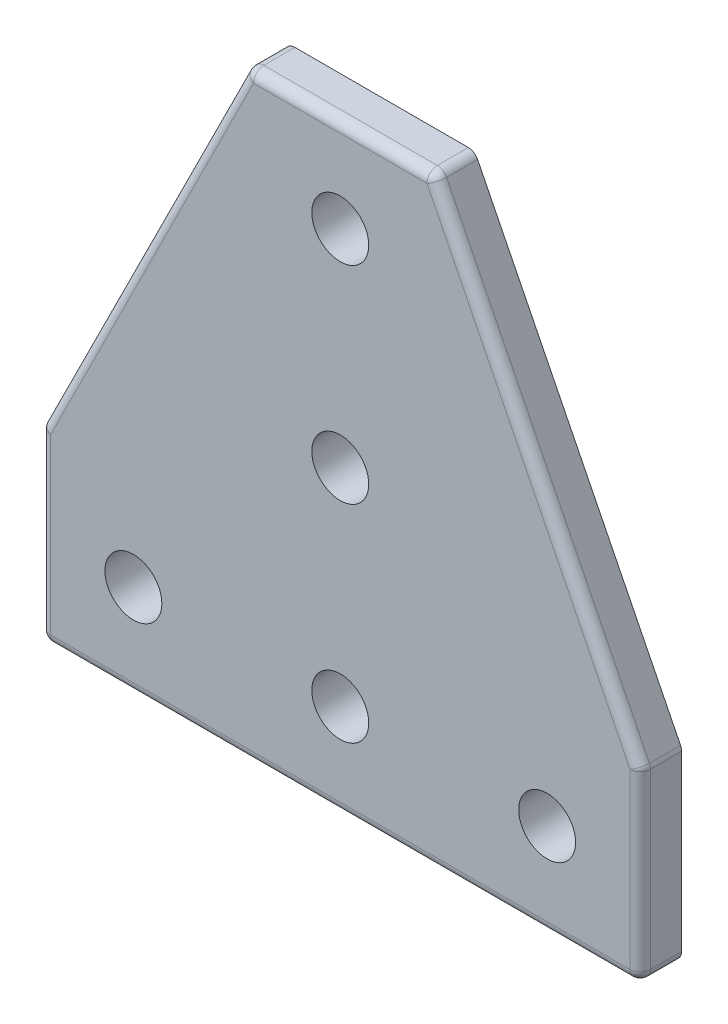
ISO-10303-21;
HEADER;
FILE_DESCRIPTION(('STEP AP214'),'2;1');
FILE_NAME('part.step','',(''),(''),'','','');
FILE_SCHEMA(('AUTOMOTIVE_DESIGN { 1 0 10303 214 1 1 1 1 }'));
ENDSEC;
DATA;
#1=APPLICATION_CONTEXT('core data for automotive mechanical design processes');
#2=APPLICATION_PROTOCOL_DEFINITION('international standard','automotive_design',2000,#1);
#3=PRODUCT_CONTEXT('',#1,'mechanical');
#4=PRODUCT('Part','Part','',(#3));
#5=PRODUCT_RELATED_PRODUCT_CATEGORY('part','',(#4));
#6=PRODUCT_DEFINITION_FORMATION('','',#4);
#7=PRODUCT_DEFINITION_CONTEXT('part definition',#1,'design');
#8=PRODUCT_DEFINITION('design','',#6,#7);
#9=PRODUCT_DEFINITION_SHAPE('','',#8);
#10=(LENGTH_UNIT() NAMED_UNIT(*) SI_UNIT(.MILLI.,.METRE.));
#11=(NAMED_UNIT(*) PLANE_ANGLE_UNIT() SI_UNIT($,.RADIAN.));
#12=(NAMED_UNIT(*) SI_UNIT($,.STERADIAN.) SOLID_ANGLE_UNIT());
#13=UNCERTAINTY_MEASURE_WITH_UNIT(LENGTH_MEASURE(1.E-05),#10,'distance_accuracy_value','');
#14=(GEOMETRIC_REPRESENTATION_CONTEXT(3) GLOBAL_UNCERTAINTY_ASSIGNED_CONTEXT((#13)) GLOBAL_UNIT_ASSIGNED_CONTEXT((#10,
#11,#12)) REPRESENTATION_CONTEXT('',''));
#15=CARTESIAN_POINT('',(0.,0.,0.));
#16=DIRECTION('',(0.,0.,1.));
#17=DIRECTION('',(1.,0.,0.));
#18=AXIS2_PLACEMENT_3D('',#15,#16,#17);
#19=CARTESIAN_POINT('',(0.,0.,2.));
#20=DIRECTION('',(0.,0.,-1.));
#21=DIRECTION('',(-1.,0.,0.));
#22=AXIS2_PLACEMENT_3D('',#19,#20,#21);
#23=PLANE('',#22);
#24=DIRECTION('',(-0.447213595499958,-0.894427190999916,0.));
#25=VECTOR('',#24,1.);
#26=CARTESIAN_POINT('',(-6.30557280900007,3.15278640450004,2.));
#27=LINE('',#26,#25);
#28=CARTESIAN_POINT('',(20.6180339887499,57.,2.));
#29=VERTEX_POINT('',#28);
#30=CARTESIAN_POINT('',(0.999999999999998,17.7639320225002,2.));
#31=VERTEX_POINT('',#30);
#32=EDGE_CURVE('E218',#29,#31,#27,.T.);
#33=ORIENTED_EDGE('',*,*,#32,.T.);
#34=DIRECTION('',(0.,-1.,0.));
#35=VECTOR('',#34,1.);
#36=CARTESIAN_POINT('',(1.,0.,2.));
#37=LINE('',#36,#35);
#38=CARTESIAN_POINT('',(1.,1.,2.));
#39=VERTEX_POINT('',#38);
#40=EDGE_CURVE('E255',#31,#39,#37,.T.);
#41=ORIENTED_EDGE('',*,*,#40,.T.);
#42=DIRECTION('',(1.,0.,0.));
#43=VECTOR('',#42,1.);
#44=CARTESIAN_POINT('',(0.,1.,2.));
#45=LINE('',#44,#43);
#46=CARTESIAN_POINT('',(57.,1.,2.));
#47=VERTEX_POINT('',#46);
#48=EDGE_CURVE('E253',#39,#47,#45,.T.);
#49=ORIENTED_EDGE('',*,*,#48,.T.);
#50=DIRECTION('',(0.,1.,0.));
#51=VECTOR('',#50,1.);
#52=CARTESIAN_POINT('',(57.,0.,2.));
#53=LINE('',#52,#51);
#54=CARTESIAN_POINT('',(57.,17.7639320225002,2.));
#55=VERTEX_POINT('',#54);
#56=EDGE_CURVE('E214',#47,#55,#53,.T.);
#57=ORIENTED_EDGE('',*,*,#56,.T.);
#58=DIRECTION('',(-0.447213595499958,0.894427190999916,0.));
#59=VECTOR('',#58,1.);
#60=CARTESIAN_POINT('',(52.7055728090001,26.3527864045,2.));
#61=LINE('',#60,#59);
#62=CARTESIAN_POINT('',(37.3819660112501,57.,2.));
#63=VERTEX_POINT('',#62);
#64=EDGE_CURVE('E206',#55,#63,#61,.T.);
#65=ORIENTED_EDGE('',*,*,#64,.T.);
#66=DIRECTION('',(-1.,0.,0.));
#67=VECTOR('',#66,1.);
#68=CARTESIAN_POINT('',(0.,57.,2.));
#69=LINE('',#68,#67);
#70=EDGE_CURVE('E211',#63,#29,#69,.T.);
#71=ORIENTED_EDGE('',*,*,#70,.T.);
#72=EDGE_LOOP('',(#33,#41,#49,#57,#65,#71));
#73=FACE_BOUND('',#72,.T.);
#74=CARTESIAN_POINT('',(29.,29.,2.));
#75=DIRECTION('',(0.,0.,1.));
#76=DIRECTION('',(1.,0.,0.));
#77=AXIS2_PLACEMENT_3D('',#74,#75,#76);
#78=CIRCLE('',#77,2.75000000000001);
#79=CARTESIAN_POINT('',(31.75,29.,2.));
#80=VERTEX_POINT('',#79);
#81=EDGE_CURVE('E348',#80,#80,#78,.T.);
#82=ORIENTED_EDGE('',*,*,#81,.F.);
#83=EDGE_LOOP('',(#82));
#84=FACE_BOUND('',#83,.T.);
#85=CARTESIAN_POINT('',(29.,8.99999999999999,2.));
#86=DIRECTION('',(0.,0.,1.));
#87=DIRECTION('',(1.,0.,0.));
#88=AXIS2_PLACEMENT_3D('',#85,#86,#87);
#89=CIRCLE('',#88,2.75);
#90=CARTESIAN_POINT('',(31.75,8.99999999999999,2.));
#91=VERTEX_POINT('',#90);
#92=EDGE_CURVE('E360',#91,#91,#89,.T.);
#93=ORIENTED_EDGE('',*,*,#92,.F.);
#94=EDGE_LOOP('',(#93));
#95=FACE_BOUND('',#94,.T.);
#96=CARTESIAN_POINT('',(9.,8.99999999999999,2.));
#97=DIRECTION('',(0.,0.,1.));
#98=DIRECTION('',(1.,0.,0.));
#99=AXIS2_PLACEMENT_3D('',#96,#97,#98);
#100=CIRCLE('',#99,2.75);
#101=CARTESIAN_POINT('',(11.75,8.99999999999999,2.));
#102=VERTEX_POINT('',#101);
#103=EDGE_CURVE('E366',#102,#102,#100,.T.);
#104=ORIENTED_EDGE('',*,*,#103,.F.);
#105=EDGE_LOOP('',(#104));
#106=FACE_BOUND('',#105,.T.);
#107=CARTESIAN_POINT('',(49.,8.99999999999999,2.));
#108=DIRECTION('',(0.,0.,1.));
#109=DIRECTION('',(1.,0.,0.));
#110=AXIS2_PLACEMENT_3D('',#107,#108,#109);
#111=CIRCLE('',#110,2.75000000000001);
#112=CARTESIAN_POINT('',(51.75,8.99999999999999,2.));
#113=VERTEX_POINT('',#112);
#114=EDGE_CURVE('E354',#113,#113,#111,.T.);
#115=ORIENTED_EDGE('',*,*,#114,.F.);
#116=EDGE_LOOP('',(#115));
#117=FACE_BOUND('',#116,.T.);
#118=CARTESIAN_POINT('',(29.,49.,2.));
#119=DIRECTION('',(0.,0.,1.));
#120=DIRECTION('',(1.,0.,0.));
#121=AXIS2_PLACEMENT_3D('',#118,#119,#120);
#122=CIRCLE('',#121,2.75);
#123=CARTESIAN_POINT('',(31.75,49.,2.));
#124=VERTEX_POINT('',#123);
#125=EDGE_CURVE('E340',#124,#124,#122,.T.);
#126=ORIENTED_EDGE('',*,*,#125,.F.);
#127=EDGE_LOOP('',(#126));
#128=FACE_BOUND('',#127,.T.);
#129=ADVANCED_FACE('F100',(#73,#84,#95,#106,#117,#128),#23,.F.);
#130=CARTESIAN_POINT('',(0.,0.,-2.));
#131=DIRECTION('',(0.,0.,-1.));
#132=DIRECTION('',(-1.,0.,0.));
#133=AXIS2_PLACEMENT_3D('',#130,#131,#132);
#134=PLANE('',#133);
#135=CARTESIAN_POINT('',(29.,29.,-2.));
#136=DIRECTION('',(0.,0.,1.));
#137=DIRECTION('',(1.,0.,0.));
#138=AXIS2_PLACEMENT_3D('',#135,#136,#137);
#139=CIRCLE('',#138,2.75000000000001);
#140=CARTESIAN_POINT('',(31.75,29.,-2.));
#141=VERTEX_POINT('',#140);
#142=EDGE_CURVE('E345',#141,#141,#139,.T.);
#143=ORIENTED_EDGE('',*,*,#142,.T.);
#144=EDGE_LOOP('',(#143));
#145=FACE_BOUND('',#144,.T.);
#146=CARTESIAN_POINT('',(29.,8.99999999999999,-2.));
#147=DIRECTION('',(0.,0.,1.));
#148=DIRECTION('',(1.,0.,0.));
#149=AXIS2_PLACEMENT_3D('',#146,#147,#148);
#150=CIRCLE('',#149,2.75);
#151=CARTESIAN_POINT('',(31.75,8.99999999999999,-2.));
#152=VERTEX_POINT('',#151);
#153=EDGE_CURVE('E357',#152,#152,#150,.T.);
#154=ORIENTED_EDGE('',*,*,#153,.T.);
#155=EDGE_LOOP('',(#154));
#156=FACE_BOUND('',#155,.T.);
#157=DIRECTION('',(-0.447213595499958,-0.894427190999916,0.));
#158=VECTOR('',#157,1.);
#159=CARTESIAN_POINT('',(0.,18.,-2.));
#160=LINE('',#159,#158);
#161=CARTESIAN_POINT('',(19.72360679775,57.4472135955,-2.));
#162=VERTEX_POINT('',#161);
#163=CARTESIAN_POINT('',(0.105572809000083,18.2111456180001,-2.));
#164=VERTEX_POINT('',#163);
#165=EDGE_CURVE('E247',#162,#164,#160,.T.);
#166=ORIENTED_EDGE('',*,*,#165,.F.);
#167=CARTESIAN_POINT('',(20.6180339887499,57.,-2.));
#168=DIRECTION('',(0.,0.,-1.));
#169=DIRECTION('',(-1.,0.,0.));
#170=AXIS2_PLACEMENT_3D('',#167,#168,#169);
#171=CIRCLE('',#170,1.);
#172=CARTESIAN_POINT('',(20.6180339887499,58.,-2.));
#173=VERTEX_POINT('',#172);
#174=EDGE_CURVE('E274',#162,#173,#171,.T.);
#175=ORIENTED_EDGE('',*,*,#174,.T.);
#176=DIRECTION('',(-1.,0.,0.));
#177=VECTOR('',#176,1.);
#178=CARTESIAN_POINT('',(38.,58.,-2.));
#179=LINE('',#178,#177);
#180=CARTESIAN_POINT('',(37.3819660112501,58.,-2.));
#181=VERTEX_POINT('',#180);
#182=EDGE_CURVE('E379',#181,#173,#179,.T.);
#183=ORIENTED_EDGE('',*,*,#182,.F.);
#184=CARTESIAN_POINT('',(37.3819660112501,57.,-2.));
#185=DIRECTION('',(0.,0.,-1.));
#186=DIRECTION('',(-1.,0.,0.));
#187=AXIS2_PLACEMENT_3D('',#184,#185,#186);
#188=CIRCLE('',#187,1.);
#189=CARTESIAN_POINT('',(38.27639320225,57.4472135955,-2.));
#190=VERTEX_POINT('',#189);
#191=EDGE_CURVE('E268',#181,#190,#188,.T.);
#192=ORIENTED_EDGE('',*,*,#191,.T.);
#193=DIRECTION('',(-0.447213595499958,0.894427190999916,0.));
#194=VECTOR('',#193,1.);
#195=CARTESIAN_POINT('',(38.,58.,-2.));
#196=LINE('',#195,#194);
#197=CARTESIAN_POINT('',(57.8944271909999,18.2111456180002,-2.));
#198=VERTEX_POINT('',#197);
#199=EDGE_CURVE('E376',#198,#190,#196,.T.);
#200=ORIENTED_EDGE('',*,*,#199,.F.);
#201=CARTESIAN_POINT('',(57.,17.7639320225002,-2.));
#202=DIRECTION('',(0.,0.,-1.));
#203=DIRECTION('',(-1.,0.,0.));
#204=AXIS2_PLACEMENT_3D('',#201,#202,#203);
#205=CIRCLE('',#204,1.);
#206=CARTESIAN_POINT('',(58.,17.7639320225002,-2.));
#207=VERTEX_POINT('',#206);
#208=EDGE_CURVE('E270',#198,#207,#205,.T.);
#209=ORIENTED_EDGE('',*,*,#208,.T.);
#210=DIRECTION('',(0.,1.,0.));
#211=VECTOR('',#210,1.);
#212=CARTESIAN_POINT('',(58.,18.,-2.));
#213=LINE('',#212,#211);
#214=CARTESIAN_POINT('',(58.,1.,-2.));
#215=VERTEX_POINT('',#214);
#216=EDGE_CURVE('E373',#215,#207,#213,.T.);
#217=ORIENTED_EDGE('',*,*,#216,.F.);
#218=CARTESIAN_POINT('',(57.,1.,-2.));
#219=DIRECTION('',(0.,0.,-1.));
#220=DIRECTION('',(-1.,0.,0.));
#221=AXIS2_PLACEMENT_3D('',#218,#219,#220);
#222=CIRCLE('',#221,1.);
#223=CARTESIAN_POINT('',(57.,0.,-2.));
#224=VERTEX_POINT('',#223);
#225=EDGE_CURVE('E264',#215,#224,#222,.T.);
#226=ORIENTED_EDGE('',*,*,#225,.T.);
#227=DIRECTION('',(1.,0.,0.));
#228=VECTOR('',#227,1.);
#229=CARTESIAN_POINT('',(58.,0.,-2.));
#230=LINE('',#229,#228);
#231=CARTESIAN_POINT('',(1.00000000000001,0.,-2.));
#232=VERTEX_POINT('',#231);
#233=EDGE_CURVE('E369',#232,#224,#230,.T.);
#234=ORIENTED_EDGE('',*,*,#233,.F.);
#235=CARTESIAN_POINT('',(1.,1.,-2.));
#236=DIRECTION('',(0.,0.,-1.));
#237=DIRECTION('',(-1.,0.,0.));
#238=AXIS2_PLACEMENT_3D('',#235,#236,#237);
#239=CIRCLE('',#238,1.);
#240=CARTESIAN_POINT('',(0.,1.,-2.));
#241=VERTEX_POINT('',#240);
#242=EDGE_CURVE('E266',#232,#241,#239,.T.);
#243=ORIENTED_EDGE('',*,*,#242,.T.);
#244=DIRECTION('',(0.,-1.,0.));
#245=VECTOR('',#244,1.);
#246=CARTESIAN_POINT('',(0.,0.,-2.));
#247=LINE('',#246,#245);
#248=CARTESIAN_POINT('',(0.,17.7639320225002,-2.));
#249=VERTEX_POINT('',#248);
#250=EDGE_CURVE('E244',#249,#241,#247,.T.);
#251=ORIENTED_EDGE('',*,*,#250,.F.);
#252=CARTESIAN_POINT('',(0.999999999999998,17.7639320225002,-2.));
#253=DIRECTION('',(0.,0.,-1.));
#254=DIRECTION('',(-1.,0.,0.));
#255=AXIS2_PLACEMENT_3D('',#252,#253,#254);
#256=CIRCLE('',#255,1.);
#257=EDGE_CURVE('E272',#249,#164,#256,.T.);
#258=ORIENTED_EDGE('',*,*,#257,.T.);
#259=EDGE_LOOP('',(#166,#175,#183,#192,#200,#209,#217,#226,#234,#243,#251,#258));
#260=FACE_BOUND('',#259,.T.);
#261=CARTESIAN_POINT('',(9.,8.99999999999999,-2.));
#262=DIRECTION('',(0.,0.,1.));
#263=DIRECTION('',(1.,0.,0.));
#264=AXIS2_PLACEMENT_3D('',#261,#262,#263);
#265=CIRCLE('',#264,2.75);
#266=CARTESIAN_POINT('',(11.75,8.99999999999999,-2.));
#267=VERTEX_POINT('',#266);
#268=EDGE_CURVE('E363',#267,#267,#265,.T.);
#269=ORIENTED_EDGE('',*,*,#268,.T.);
#270=EDGE_LOOP('',(#269));
#271=FACE_BOUND('',#270,.T.);
#272=CARTESIAN_POINT('',(49.,8.99999999999999,-2.));
#273=DIRECTION('',(0.,0.,1.));
#274=DIRECTION('',(1.,0.,0.));
#275=AXIS2_PLACEMENT_3D('',#272,#273,#274);
#276=CIRCLE('',#275,2.75000000000001);
#277=CARTESIAN_POINT('',(51.75,8.99999999999999,-2.));
#278=VERTEX_POINT('',#277);
#279=EDGE_CURVE('E351',#278,#278,#276,.T.);
#280=ORIENTED_EDGE('',*,*,#279,.T.);
#281=EDGE_LOOP('',(#280));
#282=FACE_BOUND('',#281,.T.);
#283=CARTESIAN_POINT('',(29.,49.,-2.));
#284=DIRECTION('',(0.,0.,1.));
#285=DIRECTION('',(1.,0.,0.));
#286=AXIS2_PLACEMENT_3D('',#283,#284,#285);
#287=CIRCLE('',#286,2.75);
#288=CARTESIAN_POINT('',(31.75,49.,-2.));
#289=VERTEX_POINT('',#288);
#290=EDGE_CURVE('E337',#289,#289,#287,.T.);
#291=ORIENTED_EDGE('',*,*,#290,.T.);
#292=EDGE_LOOP('',(#291));
#293=FACE_BOUND('',#292,.T.);
#294=ADVANCED_FACE('F421',(#145,#156,#260,#271,#282,#293),#134,.T.);
#295=CARTESIAN_POINT('',(58.,0.,2.));
#296=DIRECTION('',(0.,1.,0.));
#297=DIRECTION('',(-1.,0.,0.));
#298=AXIS2_PLACEMENT_3D('',#295,#296,#297);
#299=PLANE('',#298);
#300=DIRECTION('',(1.,0.,0.));
#301=VECTOR('',#300,1.);
#302=CARTESIAN_POINT('',(58.,0.,1.));
#303=LINE('',#302,#301);
#304=CARTESIAN_POINT('',(57.,0.,1.));
#305=VERTEX_POINT('',#304);
#306=CARTESIAN_POINT('',(1.,0.,1.));
#307=VERTEX_POINT('',#306);
#308=EDGE_CURVE('E109',#305,#307,#303,.F.);
#309=ORIENTED_EDGE('',*,*,#308,.T.);
#310=DIRECTION('',(0.,0.,-1.));
#311=VECTOR('',#310,1.);
#312=CARTESIAN_POINT('',(1.,0.,2.));
#313=LINE('',#312,#311);
#314=EDGE_CURVE('E12',#307,#232,#313,.T.);
#315=ORIENTED_EDGE('',*,*,#314,.T.);
#316=ORIENTED_EDGE('',*,*,#233,.T.);
#317=DIRECTION('',(0.,0.,-1.));
#318=VECTOR('',#317,1.);
#319=CARTESIAN_POINT('',(57.,0.,2.));
#320=LINE('',#319,#318);
#321=EDGE_CURVE('E120',#224,#305,#320,.F.);
#322=ORIENTED_EDGE('',*,*,#321,.T.);
#323=EDGE_LOOP('',(#309,#315,#316,#322));
#324=FACE_BOUND('',#323,.T.);
#325=ADVANCED_FACE('F420',(#324),#299,.F.);
#326=CARTESIAN_POINT('',(58.,18.,2.));
#327=DIRECTION('',(-1.,0.,0.));
#328=DIRECTION('',(0.,0.,1.));
#329=AXIS2_PLACEMENT_3D('',#326,#327,#328);
#330=PLANE('',#329);
#331=ORIENTED_EDGE('',*,*,#216,.T.);
#332=DIRECTION('',(0.,0.,-1.));
#333=VECTOR('',#332,1.);
#334=CARTESIAN_POINT('',(58.,17.7639320225002,2.));
#335=LINE('',#334,#333);
#336=CARTESIAN_POINT('',(58.,17.7639320225002,1.));
#337=VERTEX_POINT('',#336);
#338=EDGE_CURVE('E297',#207,#337,#335,.F.);
#339=ORIENTED_EDGE('',*,*,#338,.T.);
#340=DIRECTION('',(0.,1.,0.));
#341=VECTOR('',#340,1.);
#342=CARTESIAN_POINT('',(58.,18.,1.));
#343=LINE('',#342,#341);
#344=CARTESIAN_POINT('',(58.,1.,1.));
#345=VERTEX_POINT('',#344);
#346=EDGE_CURVE('E295',#337,#345,#343,.F.);
#347=ORIENTED_EDGE('',*,*,#346,.T.);
#348=DIRECTION('',(0.,0.,-1.));
#349=VECTOR('',#348,1.);
#350=CARTESIAN_POINT('',(58.,1.,2.));
#351=LINE('',#350,#349);
#352=EDGE_CURVE('E293',#345,#215,#351,.T.);
#353=ORIENTED_EDGE('',*,*,#352,.T.);
#354=EDGE_LOOP('',(#331,#339,#347,#353));
#355=FACE_BOUND('',#354,.T.);
#356=ADVANCED_FACE('F469',(#355),#330,.F.);
#357=CARTESIAN_POINT('',(38.,58.,2.));
#358=DIRECTION('',(-0.894427190999916,-0.447213595499958,0.));
#359=DIRECTION('',(0.447213595499958,-0.894427190999916,0.));
#360=AXIS2_PLACEMENT_3D('',#357,#358,#359);
#361=PLANE('',#360);
#362=DIRECTION('',(-0.447213595499958,0.894427190999916,0.));
#363=VECTOR('',#362,1.);
#364=CARTESIAN_POINT('',(38.,58.,1.));
#365=LINE('',#364,#363);
#366=CARTESIAN_POINT('',(38.27639320225,57.4472135955,1.));
#367=VERTEX_POINT('',#366);
#368=CARTESIAN_POINT('',(57.8944271909999,18.2111456180002,1.));
#369=VERTEX_POINT('',#368);
#370=EDGE_CURVE('E225',#367,#369,#365,.F.);
#371=ORIENTED_EDGE('',*,*,#370,.T.);
#372=DIRECTION('',(0.,0.,-1.));
#373=VECTOR('',#372,1.);
#374=CARTESIAN_POINT('',(57.8944271909999,18.2111456180002,2.));
#375=LINE('',#374,#373);
#376=EDGE_CURVE('E291',#369,#198,#375,.T.);
#377=ORIENTED_EDGE('',*,*,#376,.T.);
#378=ORIENTED_EDGE('',*,*,#199,.T.);
#379=DIRECTION('',(0.,0.,-1.));
#380=VECTOR('',#379,1.);
#381=CARTESIAN_POINT('',(38.27639320225,57.4472135955,2.));
#382=LINE('',#381,#380);
#383=EDGE_CURVE('E288',#190,#367,#382,.F.);
#384=ORIENTED_EDGE('',*,*,#383,.T.);
#385=EDGE_LOOP('',(#371,#377,#378,#384));
#386=FACE_BOUND('',#385,.T.);
#387=ADVANCED_FACE('F465',(#386),#361,.F.);
#388=CARTESIAN_POINT('',(38.,58.,2.));
#389=DIRECTION('',(0.,-1.,0.));
#390=DIRECTION('',(0.,0.,-1.));
#391=AXIS2_PLACEMENT_3D('',#388,#389,#390);
#392=PLANE('',#391);
#393=ORIENTED_EDGE('',*,*,#182,.T.);
#394=DIRECTION('',(0.,0.,-1.));
#395=VECTOR('',#394,1.);
#396=CARTESIAN_POINT('',(20.6180339887499,58.,2.));
#397=LINE('',#396,#395);
#398=CARTESIAN_POINT('',(20.6180339887499,58.,1.));
#399=VERTEX_POINT('',#398);
#400=EDGE_CURVE('E280',#173,#399,#397,.F.);
#401=ORIENTED_EDGE('',*,*,#400,.T.);
#402=DIRECTION('',(-1.,0.,0.));
#403=VECTOR('',#402,1.);
#404=CARTESIAN_POINT('',(38.,58.,1.));
#405=LINE('',#404,#403);
#406=CARTESIAN_POINT('',(37.3819660112501,58.,1.));
#407=VERTEX_POINT('',#406);
#408=EDGE_CURVE('E276',#399,#407,#405,.F.);
#409=ORIENTED_EDGE('',*,*,#408,.T.);
#410=DIRECTION('',(0.,0.,-1.));
#411=VECTOR('',#410,1.);
#412=CARTESIAN_POINT('',(37.3819660112501,58.,2.));
#413=LINE('',#412,#411);
#414=EDGE_CURVE('E278',#407,#181,#413,.T.);
#415=ORIENTED_EDGE('',*,*,#414,.T.);
#416=EDGE_LOOP('',(#393,#401,#409,#415));
#417=FACE_BOUND('',#416,.T.);
#418=ADVANCED_FACE('F462',(#417),#392,.F.);
#419=CARTESIAN_POINT('',(0.,18.,2.));
#420=DIRECTION('',(0.894427190999916,-0.447213595499958,0.));
#421=DIRECTION('',(0.447213595499958,0.894427190999916,0.));
#422=AXIS2_PLACEMENT_3D('',#419,#420,#421);
#423=PLANE('',#422);
#424=DIRECTION('',(-0.447213595499958,-0.894427190999916,0.));
#425=VECTOR('',#424,1.);
#426=CARTESIAN_POINT('',(0.,18.,1.));
#427=LINE('',#426,#425);
#428=CARTESIAN_POINT('',(0.105572809000083,18.2111456180001,1.));
#429=VERTEX_POINT('',#428);
#430=CARTESIAN_POINT('',(19.72360679775,57.4472135955,1.));
#431=VERTEX_POINT('',#430);
#432=EDGE_CURVE('E259',#429,#431,#427,.F.);
#433=ORIENTED_EDGE('',*,*,#432,.T.);
#434=DIRECTION('',(0.,0.,-1.));
#435=VECTOR('',#434,1.);
#436=CARTESIAN_POINT('',(19.72360679775,57.4472135955,2.));
#437=LINE('',#436,#435);
#438=EDGE_CURVE('E262',#431,#162,#437,.T.);
#439=ORIENTED_EDGE('',*,*,#438,.T.);
#440=ORIENTED_EDGE('',*,*,#165,.T.);
#441=DIRECTION('',(0.,0.,-1.));
#442=VECTOR('',#441,1.);
#443=CARTESIAN_POINT('',(0.105572809000083,18.2111456180001,2.));
#444=LINE('',#443,#442);
#445=EDGE_CURVE('E257',#164,#429,#444,.F.);
#446=ORIENTED_EDGE('',*,*,#445,.T.);
#447=EDGE_LOOP('',(#433,#439,#440,#446));
#448=FACE_BOUND('',#447,.T.);
#449=ADVANCED_FACE('F385',(#448),#423,.F.);
#450=CARTESIAN_POINT('',(0.,0.,2.));
#451=DIRECTION('',(1.,0.,0.));
#452=DIRECTION('',(0.,1.,0.));
#453=AXIS2_PLACEMENT_3D('',#450,#451,#452);
#454=PLANE('',#453);
#455=DIRECTION('',(0.,-1.,0.));
#456=VECTOR('',#455,1.);
#457=CARTESIAN_POINT('',(0.,0.,1.));
#458=LINE('',#457,#456);
#459=CARTESIAN_POINT('',(0.,1.,1.));
#460=VERTEX_POINT('',#459);
#461=CARTESIAN_POINT('',(0.,17.7639320225002,1.));
#462=VERTEX_POINT('',#461);
#463=EDGE_CURVE('E282',#460,#462,#458,.F.);
#464=ORIENTED_EDGE('',*,*,#463,.T.);
#465=DIRECTION('',(0.,0.,-1.));
#466=VECTOR('',#465,1.);
#467=CARTESIAN_POINT('',(0.,17.7639320225002,2.));
#468=LINE('',#467,#466);
#469=EDGE_CURVE('E286',#462,#249,#468,.T.);
#470=ORIENTED_EDGE('',*,*,#469,.T.);
#471=ORIENTED_EDGE('',*,*,#250,.T.);
#472=DIRECTION('',(0.,0.,-1.));
#473=VECTOR('',#472,1.);
#474=CARTESIAN_POINT('',(0.,1.,2.));
#475=LINE('',#474,#473);
#476=EDGE_CURVE('E284',#241,#460,#475,.F.);
#477=ORIENTED_EDGE('',*,*,#476,.T.);
#478=EDGE_LOOP('',(#464,#470,#471,#477));
#479=FACE_BOUND('',#478,.T.);
#480=ADVANCED_FACE('F456',(#479),#454,.F.);
#481=CARTESIAN_POINT('',(9.,8.99999999999999,2.));
#482=DIRECTION('',(0.,0.,-1.));
#483=DIRECTION('',(-1.,0.,0.));
#484=AXIS2_PLACEMENT_3D('',#481,#482,#483);
#485=CYLINDRICAL_SURFACE('',#484,2.75);
#486=ORIENTED_EDGE('',*,*,#103,.T.);
#487=EDGE_LOOP('',(#486));
#488=FACE_BOUND('',#487,.T.);
#489=ORIENTED_EDGE('',*,*,#268,.F.);
#490=EDGE_LOOP('',(#489));
#491=FACE_BOUND('',#490,.T.);
#492=ADVANCED_FACE('F453',(#488,#491),#485,.F.);
#493=CARTESIAN_POINT('',(29.,8.99999999999999,2.));
#494=DIRECTION('',(0.,0.,-1.));
#495=DIRECTION('',(-1.,0.,0.));
#496=AXIS2_PLACEMENT_3D('',#493,#494,#495);
#497=CYLINDRICAL_SURFACE('',#496,2.75);
#498=ORIENTED_EDGE('',*,*,#92,.T.);
#499=EDGE_LOOP('',(#498));
#500=FACE_BOUND('',#499,.T.);
#501=ORIENTED_EDGE('',*,*,#153,.F.);
#502=EDGE_LOOP('',(#501));
#503=FACE_BOUND('',#502,.T.);
#504=ADVANCED_FACE('F535',(#500,#503),#497,.F.);
#505=CARTESIAN_POINT('',(49.,8.99999999999999,2.));
#506=DIRECTION('',(0.,0.,-1.));
#507=DIRECTION('',(-1.,0.,0.));
#508=AXIS2_PLACEMENT_3D('',#505,#506,#507);
#509=CYLINDRICAL_SURFACE('',#508,2.75000000000001);
#510=ORIENTED_EDGE('',*,*,#114,.T.);
#511=EDGE_LOOP('',(#510));
#512=FACE_BOUND('',#511,.T.);
#513=ORIENTED_EDGE('',*,*,#279,.F.);
#514=EDGE_LOOP('',(#513));
#515=FACE_BOUND('',#514,.T.);
#516=ADVANCED_FACE('F529',(#512,#515),#509,.F.);
#517=CARTESIAN_POINT('',(29.,29.,2.));
#518=DIRECTION('',(0.,0.,-1.));
#519=DIRECTION('',(-1.,0.,0.));
#520=AXIS2_PLACEMENT_3D('',#517,#518,#519);
#521=CYLINDRICAL_SURFACE('',#520,2.75000000000001);
#522=ORIENTED_EDGE('',*,*,#81,.T.);
#523=EDGE_LOOP('',(#522));
#524=FACE_BOUND('',#523,.T.);
#525=ORIENTED_EDGE('',*,*,#142,.F.);
#526=EDGE_LOOP('',(#525));
#527=FACE_BOUND('',#526,.T.);
#528=ADVANCED_FACE('F523',(#524,#527),#521,.F.);
#529=CARTESIAN_POINT('',(29.,49.,2.));
#530=DIRECTION('',(0.,0.,-1.));
#531=DIRECTION('',(-1.,0.,0.));
#532=AXIS2_PLACEMENT_3D('',#529,#530,#531);
#533=CYLINDRICAL_SURFACE('',#532,2.75);
#534=ORIENTED_EDGE('',*,*,#125,.T.);
#535=EDGE_LOOP('',(#534));
#536=FACE_BOUND('',#535,.T.);
#537=ORIENTED_EDGE('',*,*,#290,.F.);
#538=EDGE_LOOP('',(#537));
#539=FACE_BOUND('',#538,.T.);
#540=ADVANCED_FACE('F518',(#536,#539),#533,.F.);
#541=CARTESIAN_POINT('',(57.,17.7639320225002,2.));
#542=DIRECTION('',(0.,0.,-1.));
#543=DIRECTION('',(-1.,0.,0.));
#544=AXIS2_PLACEMENT_3D('',#541,#542,#543);
#545=CYLINDRICAL_SURFACE('',#544,1.);
#546=ORIENTED_EDGE('',*,*,#208,.F.);
#547=ORIENTED_EDGE('',*,*,#376,.F.);
#548=CARTESIAN_POINT('',(57.,17.7639320225002,1.));
#549=DIRECTION('',(0.,0.,1.));
#550=DIRECTION('',(1.,0.,0.));
#551=AXIS2_PLACEMENT_3D('',#548,#549,#550);
#552=CIRCLE('',#551,1.);
#553=EDGE_CURVE('E104',#337,#369,#552,.T.);
#554=ORIENTED_EDGE('',*,*,#553,.F.);
#555=ORIENTED_EDGE('',*,*,#338,.F.);
#556=EDGE_LOOP('',(#546,#547,#554,#555));
#557=FACE_BOUND('',#556,.T.);
#558=ADVANCED_FACE('F102',(#557),#545,.T.);
#559=CARTESIAN_POINT('',(57.,0.,1.));
#560=DIRECTION('',(0.,1.,0.));
#561=DIRECTION('',(0.,0.,1.));
#562=AXIS2_PLACEMENT_3D('',#559,#560,#561);
#563=CYLINDRICAL_SURFACE('',#562,1.);
#564=CARTESIAN_POINT('',(57.,1.,1.));
#565=DIRECTION('',(0.,-1.,0.));
#566=DIRECTION('',(0.,0.,-1.));
#567=AXIS2_PLACEMENT_3D('',#564,#565,#566);
#568=CIRCLE('',#567,1.);
#569=EDGE_CURVE('E330',#345,#47,#568,.T.);
#570=ORIENTED_EDGE('',*,*,#569,.F.);
#571=ORIENTED_EDGE('',*,*,#346,.F.);
#572=CARTESIAN_POINT('',(57.,17.7639320225002,1.));
#573=DIRECTION('',(0.,1.,0.));
#574=DIRECTION('',(0.,0.,1.));
#575=AXIS2_PLACEMENT_3D('',#572,#573,#574);
#576=CIRCLE('',#575,1.);
#577=EDGE_CURVE('E332',#55,#337,#576,.T.);
#578=ORIENTED_EDGE('',*,*,#577,.F.);
#579=ORIENTED_EDGE('',*,*,#56,.F.);
#580=EDGE_LOOP('',(#570,#571,#578,#579));
#581=FACE_BOUND('',#580,.T.);
#582=ADVANCED_FACE('F434',(#581),#563,.T.);
#583=CARTESIAN_POINT('',(57.,1.,2.));
#584=DIRECTION('',(0.,0.,-1.));
#585=DIRECTION('',(-1.,0.,0.));
#586=AXIS2_PLACEMENT_3D('',#583,#584,#585);
#587=CYLINDRICAL_SURFACE('',#586,1.);
#588=ORIENTED_EDGE('',*,*,#225,.F.);
#589=ORIENTED_EDGE('',*,*,#352,.F.);
#590=CARTESIAN_POINT('',(57.,1.,1.));
#591=DIRECTION('',(0.,0.,1.));
#592=DIRECTION('',(1.,0.,0.));
#593=AXIS2_PLACEMENT_3D('',#590,#591,#592);
#594=CIRCLE('',#593,1.);
#595=EDGE_CURVE('E327',#305,#345,#594,.T.);
#596=ORIENTED_EDGE('',*,*,#595,.F.);
#597=ORIENTED_EDGE('',*,*,#321,.F.);
#598=EDGE_LOOP('',(#588,#589,#596,#597));
#599=FACE_BOUND('',#598,.T.);
#600=ADVANCED_FACE('F428',(#599),#587,.T.);
#601=CARTESIAN_POINT('',(57.,17.7639320225002,1.));
#602=DIRECTION('',(0.,0.,1.));
#603=DIRECTION('',(1.,0.,0.));
#604=AXIS2_PLACEMENT_3D('',#601,#602,#603);
#605=SPHERICAL_SURFACE('',#604,1.);
#606=ORIENTED_EDGE('',*,*,#577,.T.);
#607=ORIENTED_EDGE('',*,*,#553,.T.);
#608=CARTESIAN_POINT('',(57.,17.7639320225002,1.));
#609=DIRECTION('',(0.447213595499958,-0.894427190999916,0.));
#610=DIRECTION('',(0.894427190999916,0.447213595499958,0.));
#611=AXIS2_PLACEMENT_3D('',#608,#609,#610);
#612=CIRCLE('',#611,1.);
#613=EDGE_CURVE('E325',#55,#369,#612,.F.);
#614=ORIENTED_EDGE('',*,*,#613,.F.);
#615=EDGE_LOOP('',(#606,#607,#614));
#616=FACE_BOUND('',#615,.T.);
#617=ADVANCED_FACE('F435',(#616),#605,.T.);
#618=CARTESIAN_POINT('',(57.,1.,1.));
#619=DIRECTION('',(0.,0.,1.));
#620=DIRECTION('',(1.,0.,0.));
#621=AXIS2_PLACEMENT_3D('',#618,#619,#620);
#622=SPHERICAL_SURFACE('',#621,1.);
#623=ORIENTED_EDGE('',*,*,#595,.T.);
#624=ORIENTED_EDGE('',*,*,#569,.T.);
#625=CARTESIAN_POINT('',(57.,1.,1.));
#626=DIRECTION('',(1.,0.,0.));
#627=DIRECTION('',(0.,0.,-1.));
#628=AXIS2_PLACEMENT_3D('',#625,#626,#627);
#629=CIRCLE('',#628,1.);
#630=EDGE_CURVE('E322',#305,#47,#629,.F.);
#631=ORIENTED_EDGE('',*,*,#630,.F.);
#632=EDGE_LOOP('',(#623,#624,#631));
#633=FACE_BOUND('',#632,.T.);
#634=ADVANCED_FACE('F431',(#633),#622,.T.);
#635=CARTESIAN_POINT('',(37.3819660112501,57.,2.));
#636=DIRECTION('',(0.,0.,-1.));
#637=DIRECTION('',(-1.,0.,0.));
#638=AXIS2_PLACEMENT_3D('',#635,#636,#637);
#639=CYLINDRICAL_SURFACE('',#638,1.);
#640=ORIENTED_EDGE('',*,*,#191,.F.);
#641=ORIENTED_EDGE('',*,*,#414,.F.);
#642=CARTESIAN_POINT('',(37.3819660112501,57.,1.));
#643=DIRECTION('',(0.,0.,1.));
#644=DIRECTION('',(1.,0.,0.));
#645=AXIS2_PLACEMENT_3D('',#642,#643,#644);
#646=CIRCLE('',#645,1.);
#647=EDGE_CURVE('E229',#367,#407,#646,.T.);
#648=ORIENTED_EDGE('',*,*,#647,.F.);
#649=ORIENTED_EDGE('',*,*,#383,.F.);
#650=EDGE_LOOP('',(#640,#641,#648,#649));
#651=FACE_BOUND('',#650,.T.);
#652=ADVANCED_FACE('F442',(#651),#639,.T.);
#653=CARTESIAN_POINT('',(52.7055728090001,26.3527864045,1.));
#654=DIRECTION('',(-0.447213595499958,0.894427190999916,0.));
#655=DIRECTION('',(-0.894427190999916,-0.447213595499958,0.));
#656=AXIS2_PLACEMENT_3D('',#653,#654,#655);
#657=CYLINDRICAL_SURFACE('',#656,1.);
#658=ORIENTED_EDGE('',*,*,#613,.T.);
#659=ORIENTED_EDGE('',*,*,#370,.F.);
#660=CARTESIAN_POINT('',(37.3819660112501,57.,1.));
#661=DIRECTION('',(-0.447213595499958,0.894427190999916,0.));
#662=DIRECTION('',(-0.894427190999916,-0.447213595499958,0.));
#663=AXIS2_PLACEMENT_3D('',#660,#661,#662);
#664=CIRCLE('',#663,1.);
#665=EDGE_CURVE('E222',#63,#367,#664,.T.);
#666=ORIENTED_EDGE('',*,*,#665,.F.);
#667=ORIENTED_EDGE('',*,*,#64,.F.);
#668=EDGE_LOOP('',(#658,#659,#666,#667));
#669=FACE_BOUND('',#668,.T.);
#670=ADVANCED_FACE('F224',(#669),#657,.T.);
#671=CARTESIAN_POINT('',(0.,1.,1.));
#672=DIRECTION('',(1.,0.,0.));
#673=DIRECTION('',(0.,1.,0.));
#674=AXIS2_PLACEMENT_3D('',#671,#672,#673);
#675=CYLINDRICAL_SURFACE('',#674,1.);
#676=ORIENTED_EDGE('',*,*,#630,.T.);
#677=ORIENTED_EDGE('',*,*,#48,.F.);
#678=CARTESIAN_POINT('',(1.,1.,1.));
#679=DIRECTION('',(-1.,0.,0.));
#680=DIRECTION('',(0.,0.,1.));
#681=AXIS2_PLACEMENT_3D('',#678,#679,#680);
#682=CIRCLE('',#681,1.);
#683=EDGE_CURVE('E230',#307,#39,#682,.T.);
#684=ORIENTED_EDGE('',*,*,#683,.F.);
#685=ORIENTED_EDGE('',*,*,#308,.F.);
#686=EDGE_LOOP('',(#676,#677,#684,#685));
#687=FACE_BOUND('',#686,.T.);
#688=ADVANCED_FACE('F410',(#687),#675,.T.);
#689=CARTESIAN_POINT('',(1.,1.,2.));
#690=DIRECTION('',(0.,0.,-1.));
#691=DIRECTION('',(-1.,0.,0.));
#692=AXIS2_PLACEMENT_3D('',#689,#690,#691);
#693=CYLINDRICAL_SURFACE('',#692,1.);
#694=ORIENTED_EDGE('',*,*,#242,.F.);
#695=ORIENTED_EDGE('',*,*,#314,.F.);
#696=CARTESIAN_POINT('',(1.,1.,1.));
#697=DIRECTION('',(0.,0.,1.));
#698=DIRECTION('',(1.,0.,0.));
#699=AXIS2_PLACEMENT_3D('',#696,#697,#698);
#700=CIRCLE('',#699,1.);
#701=EDGE_CURVE('E237',#460,#307,#700,.T.);
#702=ORIENTED_EDGE('',*,*,#701,.F.);
#703=ORIENTED_EDGE('',*,*,#476,.F.);
#704=EDGE_LOOP('',(#694,#695,#702,#703));
#705=FACE_BOUND('',#704,.T.);
#706=ADVANCED_FACE('F418',(#705),#693,.T.);
#707=CARTESIAN_POINT('',(37.3819660112501,57.,1.));
#708=DIRECTION('',(0.,0.,1.));
#709=DIRECTION('',(1.,0.,0.));
#710=AXIS2_PLACEMENT_3D('',#707,#708,#709);
#711=SPHERICAL_SURFACE('',#710,1.);
#712=ORIENTED_EDGE('',*,*,#665,.T.);
#713=ORIENTED_EDGE('',*,*,#647,.T.);
#714=CARTESIAN_POINT('',(37.3819660112501,57.,1.));
#715=DIRECTION('',(1.,0.,0.));
#716=DIRECTION('',(0.,0.,-1.));
#717=AXIS2_PLACEMENT_3D('',#714,#715,#716);
#718=CIRCLE('',#717,1.);
#719=EDGE_CURVE('E233',#63,#407,#718,.F.);
#720=ORIENTED_EDGE('',*,*,#719,.F.);
#721=EDGE_LOOP('',(#712,#713,#720));
#722=FACE_BOUND('',#721,.T.);
#723=ADVANCED_FACE('F234',(#722),#711,.T.);
#724=CARTESIAN_POINT('',(1.,1.,1.));
#725=DIRECTION('',(0.,0.,1.));
#726=DIRECTION('',(1.,0.,0.));
#727=AXIS2_PLACEMENT_3D('',#724,#725,#726);
#728=SPHERICAL_SURFACE('',#727,1.);
#729=ORIENTED_EDGE('',*,*,#701,.T.);
#730=ORIENTED_EDGE('',*,*,#683,.T.);
#731=CARTESIAN_POINT('',(1.,1.,1.));
#732=DIRECTION('',(0.,-1.,0.));
#733=DIRECTION('',(1.,0.,0.));
#734=AXIS2_PLACEMENT_3D('',#731,#732,#733);
#735=CIRCLE('',#734,1.);
#736=EDGE_CURVE('E238',#460,#39,#735,.F.);
#737=ORIENTED_EDGE('',*,*,#736,.F.);
#738=EDGE_LOOP('',(#729,#730,#737));
#739=FACE_BOUND('',#738,.T.);
#740=ADVANCED_FACE('F413',(#739),#728,.T.);
#741=CARTESIAN_POINT('',(20.6180339887499,57.,2.));
#742=DIRECTION('',(0.,0.,-1.));
#743=DIRECTION('',(-1.,0.,0.));
#744=AXIS2_PLACEMENT_3D('',#741,#742,#743);
#745=CYLINDRICAL_SURFACE('',#744,1.);
#746=ORIENTED_EDGE('',*,*,#174,.F.);
#747=ORIENTED_EDGE('',*,*,#438,.F.);
#748=CARTESIAN_POINT('',(20.6180339887499,57.,1.));
#749=DIRECTION('',(0.,0.,1.));
#750=DIRECTION('',(1.,0.,0.));
#751=AXIS2_PLACEMENT_3D('',#748,#749,#750);
#752=CIRCLE('',#751,1.);
#753=EDGE_CURVE('E312',#399,#431,#752,.T.);
#754=ORIENTED_EDGE('',*,*,#753,.F.);
#755=ORIENTED_EDGE('',*,*,#400,.F.);
#756=EDGE_LOOP('',(#746,#747,#754,#755));
#757=FACE_BOUND('',#756,.T.);
#758=ADVANCED_FACE('F490',(#757),#745,.T.);
#759=CARTESIAN_POINT('',(0.,57.,1.));
#760=DIRECTION('',(-1.,0.,0.));
#761=DIRECTION('',(0.,0.,1.));
#762=AXIS2_PLACEMENT_3D('',#759,#760,#761);
#763=CYLINDRICAL_SURFACE('',#762,1.);
#764=ORIENTED_EDGE('',*,*,#719,.T.);
#765=ORIENTED_EDGE('',*,*,#408,.F.);
#766=CARTESIAN_POINT('',(20.6180339887499,57.,1.));
#767=DIRECTION('',(-1.,0.,0.));
#768=DIRECTION('',(0.,0.,1.));
#769=AXIS2_PLACEMENT_3D('',#766,#767,#768);
#770=CIRCLE('',#769,1.);
#771=EDGE_CURVE('E242',#29,#399,#770,.T.);
#772=ORIENTED_EDGE('',*,*,#771,.F.);
#773=ORIENTED_EDGE('',*,*,#70,.F.);
#774=EDGE_LOOP('',(#764,#765,#772,#773));
#775=FACE_BOUND('',#774,.T.);
#776=ADVANCED_FACE('F240',(#775),#763,.T.);
#777=CARTESIAN_POINT('',(1.,0.,1.));
#778=DIRECTION('',(0.,-1.,0.));
#779=DIRECTION('',(1.,0.,0.));
#780=AXIS2_PLACEMENT_3D('',#777,#778,#779);
#781=CYLINDRICAL_SURFACE('',#780,1.);
#782=ORIENTED_EDGE('',*,*,#736,.T.);
#783=ORIENTED_EDGE('',*,*,#40,.F.);
#784=CARTESIAN_POINT('',(0.999999999999998,17.7639320225002,1.));
#785=DIRECTION('',(0.,1.,0.));
#786=DIRECTION('',(0.,0.,1.));
#787=AXIS2_PLACEMENT_3D('',#784,#785,#786);
#788=CIRCLE('',#787,1.);
#789=EDGE_CURVE('E308',#462,#31,#788,.T.);
#790=ORIENTED_EDGE('',*,*,#789,.F.);
#791=ORIENTED_EDGE('',*,*,#463,.F.);
#792=EDGE_LOOP('',(#782,#783,#790,#791));
#793=FACE_BOUND('',#792,.T.);
#794=ADVANCED_FACE('F405',(#793),#781,.T.);
#795=CARTESIAN_POINT('',(0.999999999999998,17.7639320225002,2.));
#796=DIRECTION('',(0.,0.,-1.));
#797=DIRECTION('',(-1.,0.,0.));
#798=AXIS2_PLACEMENT_3D('',#795,#796,#797);
#799=CYLINDRICAL_SURFACE('',#798,1.);
#800=ORIENTED_EDGE('',*,*,#257,.F.);
#801=ORIENTED_EDGE('',*,*,#469,.F.);
#802=CARTESIAN_POINT('',(0.999999999999999,17.7639320225002,1.));
#803=DIRECTION('',(0.,0.,1.));
#804=DIRECTION('',(1.,0.,0.));
#805=AXIS2_PLACEMENT_3D('',#802,#803,#804);
#806=CIRCLE('',#805,1.);
#807=EDGE_CURVE('E305',#429,#462,#806,.T.);
#808=ORIENTED_EDGE('',*,*,#807,.F.);
#809=ORIENTED_EDGE('',*,*,#445,.F.);
#810=EDGE_LOOP('',(#800,#801,#808,#809));
#811=FACE_BOUND('',#810,.T.);
#812=ADVANCED_FACE('F392',(#811),#799,.T.);
#813=CARTESIAN_POINT('',(20.6180339887499,57.,1.));
#814=DIRECTION('',(0.,0.,1.));
#815=DIRECTION('',(1.,0.,0.));
#816=AXIS2_PLACEMENT_3D('',#813,#814,#815);
#817=SPHERICAL_SURFACE('',#816,1.);
#818=ORIENTED_EDGE('',*,*,#771,.T.);
#819=ORIENTED_EDGE('',*,*,#753,.T.);
#820=CARTESIAN_POINT('',(20.6180339887499,57.,1.));
#821=DIRECTION('',(0.447213595499956,0.894427190999917,0.));
#822=DIRECTION('',(-0.894427190999917,0.447213595499957,0.));
#823=AXIS2_PLACEMENT_3D('',#820,#821,#822);
#824=CIRCLE('',#823,1.);
#825=EDGE_CURVE('E303',#29,#431,#824,.F.);
#826=ORIENTED_EDGE('',*,*,#825,.F.);
#827=EDGE_LOOP('',(#818,#819,#826));
#828=FACE_BOUND('',#827,.T.);
#829=ADVANCED_FACE('F480',(#828),#817,.T.);
#830=CARTESIAN_POINT('',(0.999999999999998,17.7639320225002,1.));
#831=DIRECTION('',(0.,0.,1.));
#832=DIRECTION('',(1.,0.,0.));
#833=AXIS2_PLACEMENT_3D('',#830,#831,#832);
#834=SPHERICAL_SURFACE('',#833,1.);
#835=ORIENTED_EDGE('',*,*,#807,.T.);
#836=ORIENTED_EDGE('',*,*,#789,.T.);
#837=CARTESIAN_POINT('',(0.999999999999998,17.7639320225002,1.));
#838=DIRECTION('',(-0.44721359549996,-0.894427190999915,0.));
#839=DIRECTION('',(0.894427190999915,-0.44721359549996,0.));
#840=AXIS2_PLACEMENT_3D('',#837,#838,#839);
#841=CIRCLE('',#840,1.);
#842=EDGE_CURVE('E301',#429,#31,#841,.F.);
#843=ORIENTED_EDGE('',*,*,#842,.F.);
#844=EDGE_LOOP('',(#835,#836,#843));
#845=FACE_BOUND('',#844,.T.);
#846=ADVANCED_FACE('F401',(#845),#834,.T.);
#847=CARTESIAN_POINT('',(-6.30557280900007,3.15278640450004,1.));
#848=DIRECTION('',(-0.447213595499958,-0.894427190999916,0.));
#849=DIRECTION('',(0.894427190999916,-0.447213595499958,0.));
#850=AXIS2_PLACEMENT_3D('',#847,#848,#849);
#851=CYLINDRICAL_SURFACE('',#850,1.);
#852=ORIENTED_EDGE('',*,*,#825,.T.);
#853=ORIENTED_EDGE('',*,*,#432,.F.);
#854=ORIENTED_EDGE('',*,*,#842,.T.);
#855=ORIENTED_EDGE('',*,*,#32,.F.);
#856=EDGE_LOOP('',(#852,#853,#854,#855));
#857=FACE_BOUND('',#856,.T.);
#858=ADVANCED_FACE('F399',(#857),#851,.T.);
#859=CLOSED_SHELL('',(#129,#294,#325,#356,#387,#418,#449,#480,#492,#504,#516,#528,#540,#558,
#582,#600,#617,#634,#652,#670,#688,#706,#723,#740,#758,#776,#794,#812,#829,#846,#858));
#860=MANIFOLD_SOLID_BREP('B2',#859);
#861=ADVANCED_BREP_SHAPE_REPRESENTATION('',(#18,#860),#14);
#862=SHAPE_DEFINITION_REPRESENTATION(#9,#861);
ENDSEC;
END-ISO-10303-21;
